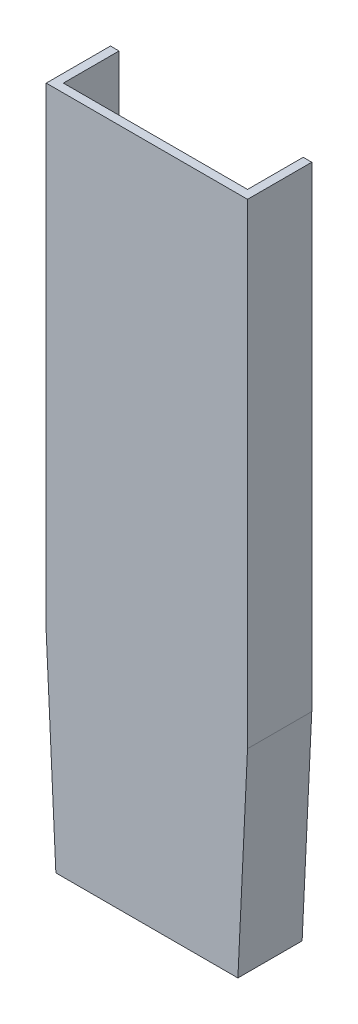
ISO-10303-21;
HEADER;
FILE_DESCRIPTION(('STEP AP214'),'2;1');
FILE_NAME('part.step','',(''),(''),'','','');
FILE_SCHEMA(('AUTOMOTIVE_DESIGN { 1 0 10303 214 1 1 1 1 }'));
ENDSEC;
DATA;
#1=APPLICATION_CONTEXT('core data for automotive mechanical design processes');
#2=APPLICATION_PROTOCOL_DEFINITION('international standard','automotive_design',2000,#1);
#3=PRODUCT_CONTEXT('',#1,'mechanical');
#4=PRODUCT('Part','Part','',(#3));
#5=PRODUCT_RELATED_PRODUCT_CATEGORY('part','',(#4));
#6=PRODUCT_DEFINITION_FORMATION('','',#4);
#7=PRODUCT_DEFINITION_CONTEXT('part definition',#1,'design');
#8=PRODUCT_DEFINITION('design','',#6,#7);
#9=PRODUCT_DEFINITION_SHAPE('','',#8);
#10=(LENGTH_UNIT() NAMED_UNIT(*) SI_UNIT(.MILLI.,.METRE.));
#11=(NAMED_UNIT(*) PLANE_ANGLE_UNIT() SI_UNIT($,.RADIAN.));
#12=(NAMED_UNIT(*) SI_UNIT($,.STERADIAN.) SOLID_ANGLE_UNIT());
#13=UNCERTAINTY_MEASURE_WITH_UNIT(LENGTH_MEASURE(1.E-05),#10,'distance_accuracy_value','');
#14=(GEOMETRIC_REPRESENTATION_CONTEXT(3) GLOBAL_UNCERTAINTY_ASSIGNED_CONTEXT((#13)) GLOBAL_UNIT_ASSIGNED_CONTEXT((#10,
#11,#12)) REPRESENTATION_CONTEXT('',''));
#15=CARTESIAN_POINT('',(0.,0.,0.));
#16=DIRECTION('',(0.,0.,1.));
#17=DIRECTION('',(1.,0.,0.));
#18=AXIS2_PLACEMENT_3D('',#15,#16,#17);
#19=CARTESIAN_POINT('',(-43.8993084198549,241.108747993579,0.));
#20=DIRECTION('',(0.,0.,-1.));
#21=DIRECTION('',(-1.,0.,0.));
#22=AXIS2_PLACEMENT_3D('',#19,#20,#21);
#23=PLANE('',#22);
#24=DIRECTION('',(0.047315368456804,0.998880000754744,0.));
#25=VECTOR('',#24,1.);
#26=CARTESIAN_POINT('',(56.3953066537427,236.357950437462,0.));
#27=LINE('',#26,#25);
#28=CARTESIAN_POINT('',(41.5962065599448,-76.0674959871589,0.));
#29=VERTEX_POINT('',#28);
#30=CARTESIAN_POINT('',(46.1006915801451,19.0271877726244,0.));
#31=VERTEX_POINT('',#30);
#32=EDGE_CURVE('E162',#29,#31,#27,.T.);
#33=ORIENTED_EDGE('',*,*,#32,.T.);
#34=DIRECTION('',(0.,1.,0.));
#35=VECTOR('',#34,1.);
#36=CARTESIAN_POINT('',(46.1006915801451,241.10874799358,0.));
#37=LINE('',#36,#35);
#38=CARTESIAN_POINT('',(46.1006915801451,241.108747993579,0.));
#39=VERTEX_POINT('',#38);
#40=EDGE_CURVE('E165',#31,#39,#37,.T.);
#41=ORIENTED_EDGE('',*,*,#40,.T.);
#42=DIRECTION('',(-1.,0.,0.));
#43=VECTOR('',#42,1.);
#44=CARTESIAN_POINT('',(-43.8993084198549,241.108747993579,0.));
#45=LINE('',#44,#43);
#46=CARTESIAN_POINT('',(50.1006915801451,241.108747993579,0.));
#47=VERTEX_POINT('',#46);
#48=EDGE_CURVE('E142',#47,#39,#45,.T.);
#49=ORIENTED_EDGE('',*,*,#48,.F.);
#50=DIRECTION('',(0.,1.,0.));
#51=VECTOR('',#50,1.);
#52=CARTESIAN_POINT('',(50.1006915801451,241.108747993579,0.));
#53=LINE('',#52,#51);
#54=CARTESIAN_POINT('',(50.1006915801451,18.9325040128411,0.));
#55=VERTEX_POINT('',#54);
#56=EDGE_CURVE('E140',#55,#47,#53,.T.);
#57=ORIENTED_EDGE('',*,*,#56,.F.);
#58=DIRECTION('',(0.047315368456804,0.998880000754744,0.));
#59=VECTOR('',#58,1.);
#60=CARTESIAN_POINT('',(45.6006915801451,-76.0674959871589,0.));
#61=LINE('',#60,#59);
#62=CARTESIAN_POINT('',(45.6006915801451,-76.0674959871589,0.));
#63=VERTEX_POINT('',#62);
#64=EDGE_CURVE('E116',#63,#55,#61,.T.);
#65=ORIENTED_EDGE('',*,*,#64,.F.);
#66=DIRECTION('',(1.,0.,0.));
#67=VECTOR('',#66,1.);
#68=CARTESIAN_POINT('',(-39.3993084198549,-76.0674959871589,0.));
#69=LINE('',#68,#67);
#70=EDGE_CURVE('E135',#29,#63,#69,.T.);
#71=ORIENTED_EDGE('',*,*,#70,.F.);
#72=EDGE_LOOP('',(#33,#41,#49,#57,#65,#71));
#73=FACE_BOUND('',#72,.T.);
#74=ADVANCED_FACE('F31',(#73),#23,.T.);
#75=CARTESIAN_POINT('',(-39.8993084198549,241.108747993579,0.));
#76=VERTEX_POINT('',#75);
#77=CARTESIAN_POINT('',(-43.8993084198549,241.108747993579,0.));
#78=VERTEX_POINT('',#77);
#79=EDGE_CURVE('E82',#76,#78,#45,.T.);
#80=ORIENTED_EDGE('',*,*,#79,.F.);
#81=DIRECTION('',(0.,-1.,0.));
#82=VECTOR('',#81,1.);
#83=CARTESIAN_POINT('',(-39.8993084198549,241.108747993579,0.));
#84=LINE('',#83,#82);
#85=CARTESIAN_POINT('',(-39.8993084198549,19.0271877726244,0.));
#86=VERTEX_POINT('',#85);
#87=EDGE_CURVE('E159',#76,#86,#84,.T.);
#88=ORIENTED_EDGE('',*,*,#87,.T.);
#89=DIRECTION('',(0.0473153684568036,-0.998880000754744,0.));
#90=VECTOR('',#89,1.);
#91=CARTESIAN_POINT('',(-50.4043654381196,240.800613713767,0.));
#92=LINE('',#91,#90);
#93=CARTESIAN_POINT('',(-35.3948233996547,-76.0674959871589,0.));
#94=VERTEX_POINT('',#93);
#95=EDGE_CURVE('E157',#86,#94,#92,.T.);
#96=ORIENTED_EDGE('',*,*,#95,.T.);
#97=CARTESIAN_POINT('',(-39.3993084198549,-76.0674959871589,0.));
#98=VERTEX_POINT('',#97);
#99=EDGE_CURVE('E136',#98,#94,#69,.T.);
#100=ORIENTED_EDGE('',*,*,#99,.F.);
#101=DIRECTION('',(0.0473153684568036,-0.998880000754744,0.));
#102=VECTOR('',#101,1.);
#103=CARTESIAN_POINT('',(-43.8993084198549,18.9325040128411,0.));
#104=LINE('',#103,#102);
#105=CARTESIAN_POINT('',(-43.8993084198549,18.9325040128411,0.));
#106=VERTEX_POINT('',#105);
#107=EDGE_CURVE('E132',#106,#98,#104,.T.);
#108=ORIENTED_EDGE('',*,*,#107,.F.);
#109=DIRECTION('',(0.,-1.,0.));
#110=VECTOR('',#109,1.);
#111=CARTESIAN_POINT('',(-43.8993084198549,18.9325040128411,0.));
#112=LINE('',#111,#110);
#113=EDGE_CURVE('E129',#78,#106,#112,.T.);
#114=ORIENTED_EDGE('',*,*,#113,.F.);
#115=EDGE_LOOP('',(#80,#88,#96,#100,#108,#114));
#116=FACE_BOUND('',#115,.T.);
#117=ADVANCED_FACE('F154',(#116),#23,.T.);
#118=CARTESIAN_POINT('',(-43.8993084198549,18.9325040128411,30.));
#119=DIRECTION('',(1.,0.,0.));
#120=DIRECTION('',(0.,0.,-1.));
#121=AXIS2_PLACEMENT_3D('',#118,#119,#120);
#122=PLANE('',#121);
#123=ORIENTED_EDGE('',*,*,#113,.T.);
#124=DIRECTION('',(0.,0.,-1.));
#125=VECTOR('',#124,1.);
#126=CARTESIAN_POINT('',(-43.8993084198549,18.9325040128411,30.));
#127=LINE('',#126,#125);
#128=CARTESIAN_POINT('',(-43.8993084198549,18.9325040128411,30.));
#129=VERTEX_POINT('',#128);
#130=EDGE_CURVE('E11',#129,#106,#127,.T.);
#131=ORIENTED_EDGE('',*,*,#130,.F.);
#132=DIRECTION('',(0.,-1.,0.));
#133=VECTOR('',#132,1.);
#134=CARTESIAN_POINT('',(-43.8993084198549,18.9325040128411,30.));
#135=LINE('',#134,#133);
#136=CARTESIAN_POINT('',(-43.8993084198549,241.108747993579,30.));
#137=VERTEX_POINT('',#136);
#138=EDGE_CURVE('E145',#137,#129,#135,.T.);
#139=ORIENTED_EDGE('',*,*,#138,.F.);
#140=DIRECTION('',(0.,0.,-1.));
#141=VECTOR('',#140,1.);
#142=CARTESIAN_POINT('',(-43.8993084198549,241.108747993579,30.));
#143=LINE('',#142,#141);
#144=EDGE_CURVE('E125',#137,#78,#143,.T.);
#145=ORIENTED_EDGE('',*,*,#144,.T.);
#146=EDGE_LOOP('',(#123,#131,#139,#145));
#147=FACE_BOUND('',#146,.T.);
#148=ADVANCED_FACE('F33',(#147),#122,.F.);
#149=CARTESIAN_POINT('',(-43.8993084198549,18.9325040128411,30.));
#150=DIRECTION('',(0.998880000754744,0.0473153684568036,0.));
#151=DIRECTION('',(-0.0473153684568036,0.998880000754744,0.));
#152=AXIS2_PLACEMENT_3D('',#149,#150,#151);
#153=PLANE('',#152);
#154=ORIENTED_EDGE('',*,*,#107,.T.);
#155=DIRECTION('',(0.,0.,-1.));
#156=VECTOR('',#155,1.);
#157=CARTESIAN_POINT('',(-39.3993084198549,-76.0674959871589,30.));
#158=LINE('',#157,#156);
#159=CARTESIAN_POINT('',(-39.3993084198549,-76.0674959871589,30.));
#160=VERTEX_POINT('',#159);
#161=EDGE_CURVE('E39',#160,#98,#158,.T.);
#162=ORIENTED_EDGE('',*,*,#161,.F.);
#163=DIRECTION('',(0.0473153684568036,-0.998880000754744,0.));
#164=VECTOR('',#163,1.);
#165=CARTESIAN_POINT('',(-43.8993084198549,18.9325040128411,30.));
#166=LINE('',#165,#164);
#167=EDGE_CURVE('E90',#129,#160,#166,.T.);
#168=ORIENTED_EDGE('',*,*,#167,.F.);
#169=ORIENTED_EDGE('',*,*,#130,.T.);
#170=EDGE_LOOP('',(#154,#162,#168,#169));
#171=FACE_BOUND('',#170,.T.);
#172=ADVANCED_FACE('F175',(#171),#153,.F.);
#173=CARTESIAN_POINT('',(-39.3993084198549,-76.0674959871589,30.));
#174=DIRECTION('',(0.,1.,0.));
#175=DIRECTION('',(0.,0.,1.));
#176=AXIS2_PLACEMENT_3D('',#173,#174,#175);
#177=PLANE('',#176);
#178=DIRECTION('',(1.,0.,0.));
#179=VECTOR('',#178,1.);
#180=CARTESIAN_POINT('',(-43.8993084198549,-76.0674959871589,26.));
#181=LINE('',#180,#179);
#182=CARTESIAN_POINT('',(-35.3948233996547,-76.0674959871589,26.));
#183=VERTEX_POINT('',#182);
#184=CARTESIAN_POINT('',(41.5962065599448,-76.0674959871589,26.));
#185=VERTEX_POINT('',#184);
#186=EDGE_CURVE('E329',#183,#185,#181,.T.);
#187=ORIENTED_EDGE('',*,*,#186,.T.);
#188=DIRECTION('',(0.,0.,-1.));
#189=VECTOR('',#188,1.);
#190=CARTESIAN_POINT('',(41.5962065599448,-76.0674959871589,30.));
#191=LINE('',#190,#189);
#192=EDGE_CURVE('E327',#185,#29,#191,.T.);
#193=ORIENTED_EDGE('',*,*,#192,.T.);
#194=ORIENTED_EDGE('',*,*,#70,.T.);
#195=DIRECTION('',(0.,0.,-1.));
#196=VECTOR('',#195,1.);
#197=CARTESIAN_POINT('',(45.6006915801451,-76.0674959871589,30.));
#198=LINE('',#197,#196);
#199=CARTESIAN_POINT('',(45.6006915801451,-76.0674959871589,30.));
#200=VERTEX_POINT('',#199);
#201=EDGE_CURVE('E119',#200,#63,#198,.T.);
#202=ORIENTED_EDGE('',*,*,#201,.F.);
#203=DIRECTION('',(1.,0.,0.));
#204=VECTOR('',#203,1.);
#205=CARTESIAN_POINT('',(-39.3993084198549,-76.0674959871589,30.));
#206=LINE('',#205,#204);
#207=EDGE_CURVE('E107',#160,#200,#206,.T.);
#208=ORIENTED_EDGE('',*,*,#207,.F.);
#209=ORIENTED_EDGE('',*,*,#161,.T.);
#210=ORIENTED_EDGE('',*,*,#99,.T.);
#211=DIRECTION('',(0.,0.,-1.));
#212=VECTOR('',#211,1.);
#213=CARTESIAN_POINT('',(-35.3948233996547,-76.0674959871589,30.));
#214=LINE('',#213,#212);
#215=EDGE_CURVE('E46',#183,#94,#214,.T.);
#216=ORIENTED_EDGE('',*,*,#215,.F.);
#217=EDGE_LOOP('',(#187,#193,#194,#202,#208,#209,#210,#216));
#218=FACE_BOUND('',#217,.T.);
#219=ADVANCED_FACE('F152',(#218),#177,.F.);
#220=CARTESIAN_POINT('',(45.6006915801451,-76.0674959871589,30.));
#221=DIRECTION('',(-0.998880000754744,0.047315368456804,0.));
#222=DIRECTION('',(-0.047315368456804,-0.998880000754744,0.));
#223=AXIS2_PLACEMENT_3D('',#220,#221,#222);
#224=PLANE('',#223);
#225=ORIENTED_EDGE('',*,*,#64,.T.);
#226=DIRECTION('',(0.,0.,-1.));
#227=VECTOR('',#226,1.);
#228=CARTESIAN_POINT('',(50.1006915801451,18.9325040128411,30.));
#229=LINE('',#228,#227);
#230=CARTESIAN_POINT('',(50.1006915801451,18.9325040128411,30.));
#231=VERTEX_POINT('',#230);
#232=EDGE_CURVE('E113',#231,#55,#229,.T.);
#233=ORIENTED_EDGE('',*,*,#232,.F.);
#234=DIRECTION('',(0.047315368456804,0.998880000754744,0.));
#235=VECTOR('',#234,1.);
#236=CARTESIAN_POINT('',(45.6006915801451,-76.0674959871589,30.));
#237=LINE('',#236,#235);
#238=EDGE_CURVE('E100',#200,#231,#237,.T.);
#239=ORIENTED_EDGE('',*,*,#238,.F.);
#240=ORIENTED_EDGE('',*,*,#201,.T.);
#241=EDGE_LOOP('',(#225,#233,#239,#240));
#242=FACE_BOUND('',#241,.T.);
#243=ADVANCED_FACE('F114',(#242),#224,.F.);
#244=CARTESIAN_POINT('',(50.1006915801451,241.108747993579,30.));
#245=DIRECTION('',(-1.,0.,0.));
#246=DIRECTION('',(0.,-1.,0.));
#247=AXIS2_PLACEMENT_3D('',#244,#245,#246);
#248=PLANE('',#247);
#249=ORIENTED_EDGE('',*,*,#56,.T.);
#250=DIRECTION('',(0.,0.,-1.));
#251=VECTOR('',#250,1.);
#252=CARTESIAN_POINT('',(50.1006915801451,241.108747993579,30.));
#253=LINE('',#252,#251);
#254=CARTESIAN_POINT('',(50.1006915801451,241.108747993579,30.));
#255=VERTEX_POINT('',#254);
#256=EDGE_CURVE('E120',#255,#47,#253,.T.);
#257=ORIENTED_EDGE('',*,*,#256,.F.);
#258=DIRECTION('',(0.,1.,0.));
#259=VECTOR('',#258,1.);
#260=CARTESIAN_POINT('',(50.1006915801451,241.108747993579,30.));
#261=LINE('',#260,#259);
#262=EDGE_CURVE('E104',#231,#255,#261,.T.);
#263=ORIENTED_EDGE('',*,*,#262,.F.);
#264=ORIENTED_EDGE('',*,*,#232,.T.);
#265=EDGE_LOOP('',(#249,#257,#263,#264));
#266=FACE_BOUND('',#265,.T.);
#267=ADVANCED_FACE('F122',(#266),#248,.F.);
#268=CARTESIAN_POINT('',(-43.8993084198549,241.108747993579,30.));
#269=DIRECTION('',(0.,-1.,0.));
#270=DIRECTION('',(0.,0.,-1.));
#271=AXIS2_PLACEMENT_3D('',#268,#269,#270);
#272=PLANE('',#271);
#273=DIRECTION('',(-1.,0.,0.));
#274=VECTOR('',#273,1.);
#275=CARTESIAN_POINT('',(-43.8993084198549,241.108747993579,26.));
#276=LINE('',#275,#274);
#277=CARTESIAN_POINT('',(46.1006915801451,241.108747993579,26.));
#278=VERTEX_POINT('',#277);
#279=CARTESIAN_POINT('',(-39.8993084198549,241.108747993579,26.));
#280=VERTEX_POINT('',#279);
#281=EDGE_CURVE('E304',#278,#280,#276,.T.);
#282=ORIENTED_EDGE('',*,*,#281,.T.);
#283=DIRECTION('',(0.,0.,-1.));
#284=VECTOR('',#283,1.);
#285=CARTESIAN_POINT('',(-39.8993084198549,241.108747993579,30.));
#286=LINE('',#285,#284);
#287=EDGE_CURVE('E313',#280,#76,#286,.T.);
#288=ORIENTED_EDGE('',*,*,#287,.T.);
#289=ORIENTED_EDGE('',*,*,#79,.T.);
#290=ORIENTED_EDGE('',*,*,#144,.F.);
#291=DIRECTION('',(-1.,0.,0.));
#292=VECTOR('',#291,1.);
#293=CARTESIAN_POINT('',(-43.8993084198549,241.108747993579,30.));
#294=LINE('',#293,#292);
#295=EDGE_CURVE('E55',#255,#137,#294,.T.);
#296=ORIENTED_EDGE('',*,*,#295,.F.);
#297=ORIENTED_EDGE('',*,*,#256,.T.);
#298=ORIENTED_EDGE('',*,*,#48,.T.);
#299=DIRECTION('',(0.,0.,-1.));
#300=VECTOR('',#299,1.);
#301=CARTESIAN_POINT('',(46.1006915801451,241.108747993579,30.));
#302=LINE('',#301,#300);
#303=EDGE_CURVE('E315',#278,#39,#302,.T.);
#304=ORIENTED_EDGE('',*,*,#303,.F.);
#305=EDGE_LOOP('',(#282,#288,#289,#290,#296,#297,#298,#304));
#306=FACE_BOUND('',#305,.T.);
#307=ADVANCED_FACE('F191',(#306),#272,.F.);
#308=CARTESIAN_POINT('',(-43.8993084198549,241.108747993579,30.));
#309=DIRECTION('',(0.,0.,-1.));
#310=DIRECTION('',(-1.,0.,0.));
#311=AXIS2_PLACEMENT_3D('',#308,#309,#310);
#312=PLANE('',#311);
#313=ORIENTED_EDGE('',*,*,#138,.T.);
#314=ORIENTED_EDGE('',*,*,#167,.T.);
#315=ORIENTED_EDGE('',*,*,#207,.T.);
#316=ORIENTED_EDGE('',*,*,#238,.T.);
#317=ORIENTED_EDGE('',*,*,#262,.T.);
#318=ORIENTED_EDGE('',*,*,#295,.T.);
#319=EDGE_LOOP('',(#313,#314,#315,#316,#317,#318));
#320=FACE_BOUND('',#319,.T.);
#321=ADVANCED_FACE('F102',(#320),#312,.F.);
#322=CARTESIAN_POINT('',(-39.8993084198549,18.9325040128411,30.));
#323=DIRECTION('',(1.,0.,0.));
#324=DIRECTION('',(0.,0.,-1.));
#325=AXIS2_PLACEMENT_3D('',#322,#323,#324);
#326=PLANE('',#325);
#327=ORIENTED_EDGE('',*,*,#87,.F.);
#328=ORIENTED_EDGE('',*,*,#287,.F.);
#329=DIRECTION('',(0.,-1.,0.));
#330=VECTOR('',#329,1.);
#331=CARTESIAN_POINT('',(-39.8993084198549,241.108747993579,26.));
#332=LINE('',#331,#330);
#333=CARTESIAN_POINT('',(-39.8993084198549,19.0271877726244,26.));
#334=VERTEX_POINT('',#333);
#335=EDGE_CURVE('E300',#280,#334,#332,.T.);
#336=ORIENTED_EDGE('',*,*,#335,.T.);
#337=DIRECTION('',(0.,0.,-1.));
#338=VECTOR('',#337,1.);
#339=CARTESIAN_POINT('',(-39.8993084198549,19.0271877726244,30.));
#340=LINE('',#339,#338);
#341=EDGE_CURVE('E133',#334,#86,#340,.T.);
#342=ORIENTED_EDGE('',*,*,#341,.T.);
#343=EDGE_LOOP('',(#327,#328,#336,#342));
#344=FACE_BOUND('',#343,.T.);
#345=ADVANCED_FACE('F216',(#344),#326,.T.);
#346=CARTESIAN_POINT('',(-39.903788416836,19.1217654866683,30.));
#347=DIRECTION('',(0.998880000754744,0.0473153684568036,0.));
#348=DIRECTION('',(-0.0473153684568036,0.998880000754744,0.));
#349=AXIS2_PLACEMENT_3D('',#346,#347,#348);
#350=PLANE('',#349);
#351=ORIENTED_EDGE('',*,*,#95,.F.);
#352=ORIENTED_EDGE('',*,*,#341,.F.);
#353=DIRECTION('',(0.0473153684568036,-0.998880000754744,0.));
#354=VECTOR('',#353,1.);
#355=CARTESIAN_POINT('',(-50.4043654381196,240.800613713767,26.));
#356=LINE('',#355,#354);
#357=EDGE_CURVE('E308',#334,#183,#356,.T.);
#358=ORIENTED_EDGE('',*,*,#357,.T.);
#359=ORIENTED_EDGE('',*,*,#215,.T.);
#360=EDGE_LOOP('',(#351,#352,#358,#359));
#361=FACE_BOUND('',#360,.T.);
#362=ADVANCED_FACE('F221',(#361),#350,.T.);
#363=CARTESIAN_POINT('',(41.6051715771261,-75.8782345133317,30.));
#364=DIRECTION('',(-0.998880000754744,0.047315368456804,0.));
#365=DIRECTION('',(-0.047315368456804,-0.998880000754744,0.));
#366=AXIS2_PLACEMENT_3D('',#363,#364,#365);
#367=PLANE('',#366);
#368=ORIENTED_EDGE('',*,*,#32,.F.);
#369=ORIENTED_EDGE('',*,*,#192,.F.);
#370=DIRECTION('',(0.047315368456804,0.998880000754744,0.));
#371=VECTOR('',#370,1.);
#372=CARTESIAN_POINT('',(56.3953066537427,236.357950437462,26.));
#373=LINE('',#372,#371);
#374=CARTESIAN_POINT('',(46.1006915801451,19.0271877726244,26.));
#375=VERTEX_POINT('',#374);
#376=EDGE_CURVE('E320',#185,#375,#373,.T.);
#377=ORIENTED_EDGE('',*,*,#376,.T.);
#378=DIRECTION('',(0.,0.,-1.));
#379=VECTOR('',#378,1.);
#380=CARTESIAN_POINT('',(46.1006915801451,19.0271877726244,30.));
#381=LINE('',#380,#379);
#382=EDGE_CURVE('E324',#375,#31,#381,.T.);
#383=ORIENTED_EDGE('',*,*,#382,.T.);
#384=EDGE_LOOP('',(#368,#369,#377,#383));
#385=FACE_BOUND('',#384,.T.);
#386=ADVANCED_FACE('F229',(#385),#367,.T.);
#387=CARTESIAN_POINT('',(46.1006915801451,241.108747993579,30.));
#388=DIRECTION('',(-1.,0.,0.));
#389=DIRECTION('',(0.,-1.,0.));
#390=AXIS2_PLACEMENT_3D('',#387,#388,#389);
#391=PLANE('',#390);
#392=ORIENTED_EDGE('',*,*,#40,.F.);
#393=ORIENTED_EDGE('',*,*,#382,.F.);
#394=DIRECTION('',(0.,1.,0.));
#395=VECTOR('',#394,1.);
#396=CARTESIAN_POINT('',(46.1006915801451,241.10874799358,26.));
#397=LINE('',#396,#395);
#398=EDGE_CURVE('E316',#375,#278,#397,.T.);
#399=ORIENTED_EDGE('',*,*,#398,.T.);
#400=ORIENTED_EDGE('',*,*,#303,.T.);
#401=EDGE_LOOP('',(#392,#393,#399,#400));
#402=FACE_BOUND('',#401,.T.);
#403=ADVANCED_FACE('F236',(#402),#391,.T.);
#404=CARTESIAN_POINT('',(-43.8993084198549,241.108747993579,26.));
#405=DIRECTION('',(0.,0.,-1.));
#406=DIRECTION('',(-1.,0.,0.));
#407=AXIS2_PLACEMENT_3D('',#404,#405,#406);
#408=PLANE('',#407);
#409=ORIENTED_EDGE('',*,*,#335,.F.);
#410=ORIENTED_EDGE('',*,*,#281,.F.);
#411=ORIENTED_EDGE('',*,*,#398,.F.);
#412=ORIENTED_EDGE('',*,*,#376,.F.);
#413=ORIENTED_EDGE('',*,*,#186,.F.);
#414=ORIENTED_EDGE('',*,*,#357,.F.);
#415=EDGE_LOOP('',(#409,#410,#411,#412,#413,#414));
#416=FACE_BOUND('',#415,.T.);
#417=ADVANCED_FACE('F244',(#416),#408,.T.);
#418=CLOSED_SHELL('',(#74,#117,#148,#172,#219,#243,#267,#307,#321,#345,#362,#386,#403,#417));
#419=MANIFOLD_SOLID_BREP('B2',#418);
#420=ADVANCED_BREP_SHAPE_REPRESENTATION('',(#18,#419),#14);
#421=SHAPE_DEFINITION_REPRESENTATION(#9,#420);
ENDSEC;
END-ISO-10303-21;
